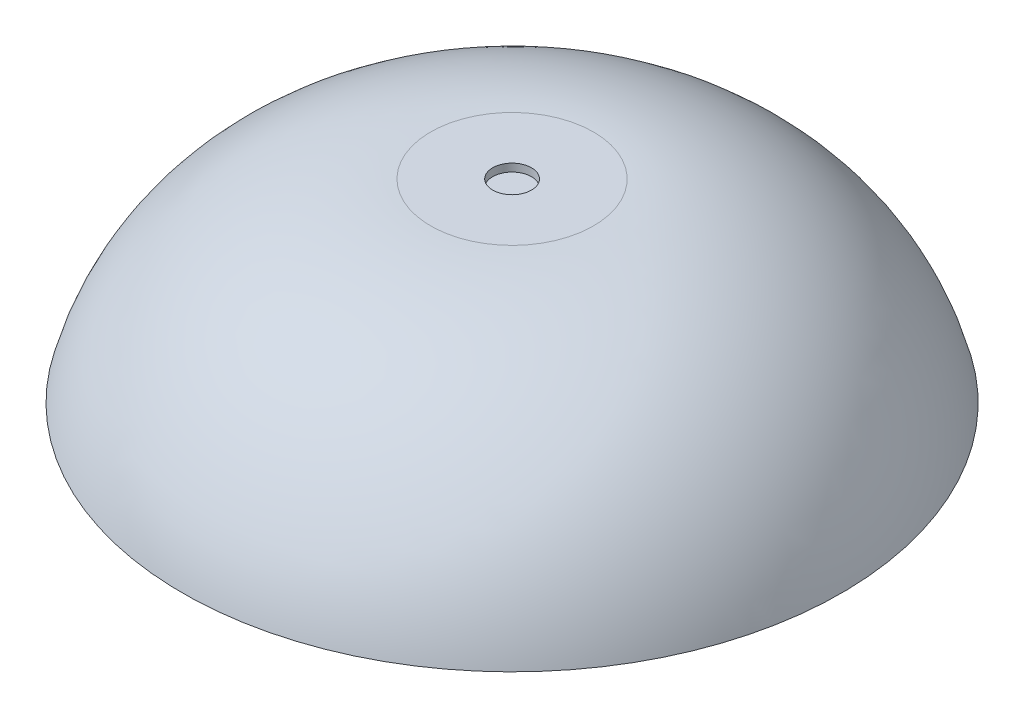
ISO-10303-21;
HEADER;
FILE_DESCRIPTION(('STEP AP214'),'2;1');
FILE_NAME('part.step','',(''),(''),'','','');
FILE_SCHEMA(('AUTOMOTIVE_DESIGN { 1 0 10303 214 1 1 1 1 }'));
ENDSEC;
DATA;
#1=APPLICATION_CONTEXT('core data for automotive mechanical design processes');
#2=APPLICATION_PROTOCOL_DEFINITION('international standard','automotive_design',2000,#1);
#3=PRODUCT_CONTEXT('',#1,'mechanical');
#4=PRODUCT('Part','Part','',(#3));
#5=PRODUCT_RELATED_PRODUCT_CATEGORY('part','',(#4));
#6=PRODUCT_DEFINITION_FORMATION('','',#4);
#7=PRODUCT_DEFINITION_CONTEXT('part definition',#1,'design');
#8=PRODUCT_DEFINITION('design','',#6,#7);
#9=PRODUCT_DEFINITION_SHAPE('','',#8);
#10=(LENGTH_UNIT() NAMED_UNIT(*) SI_UNIT(.MILLI.,.METRE.));
#11=(NAMED_UNIT(*) PLANE_ANGLE_UNIT() SI_UNIT($,.RADIAN.));
#12=(NAMED_UNIT(*) SI_UNIT($,.STERADIAN.) SOLID_ANGLE_UNIT());
#13=UNCERTAINTY_MEASURE_WITH_UNIT(LENGTH_MEASURE(1.E-05),#10,'distance_accuracy_value','');
#14=(GEOMETRIC_REPRESENTATION_CONTEXT(3) GLOBAL_UNCERTAINTY_ASSIGNED_CONTEXT((#13)) GLOBAL_UNIT_ASSIGNED_CONTEXT((#10,
#11,#12)) REPRESENTATION_CONTEXT('',''));
#15=CARTESIAN_POINT('',(0.,0.,0.));
#16=DIRECTION('',(0.,0.,1.));
#17=DIRECTION('',(1.,0.,0.));
#18=AXIS2_PLACEMENT_3D('',#15,#16,#17);
#19=CARTESIAN_POINT('',(0.,2.,0.));
#20=DIRECTION('',(0.,1.,0.));
#21=DIRECTION('',(0.,0.,1.));
#22=AXIS2_PLACEMENT_3D('',#19,#20,#21);
#23=PLANE('',#22);
#24=CARTESIAN_POINT('',(0.,2.,0.));
#25=DIRECTION('',(0.,-1.,0.));
#26=DIRECTION('',(0.,0.,-1.));
#27=AXIS2_PLACEMENT_3D('',#24,#25,#26);
#28=CIRCLE('',#27,82.3866434984028);
#29=CARTESIAN_POINT('',(0.,2.,-82.3866434984028));
#30=VERTEX_POINT('',#29);
#31=EDGE_CURVE('E10',#30,#30,#28,.T.);
#32=ORIENTED_EDGE('',*,*,#31,.F.);
#33=EDGE_LOOP('',(#32));
#34=FACE_BOUND('',#33,.T.);
#35=ADVANCED_FACE('F29',(#34),#23,.T.);
#36=CARTESIAN_POINT('',(0.,-15.96,0.));
#37=DIRECTION('',(0.,-1.,0.));
#38=DIRECTION('',(0.,0.,-1.));
#39=AXIS2_PLACEMENT_3D('',#36,#37,#38);
#40=DEGENERATE_TOROIDAL_SURFACE('',#39,21.,63.96,.T.);
#41=ORIENTED_EDGE('',*,*,#31,.T.);
#42=EDGE_LOOP('',(#41));
#43=FACE_BOUND('',#42,.T.);
#44=CARTESIAN_POINT('',(0.,48.,0.));
#45=DIRECTION('',(0.,-1.,0.));
#46=DIRECTION('',(0.,0.,-1.));
#47=AXIS2_PLACEMENT_3D('',#44,#45,#46);
#48=CIRCLE('',#47,21.);
#49=CARTESIAN_POINT('',(0.,48.,-21.));
#50=VERTEX_POINT('',#49);
#51=EDGE_CURVE('E35',#50,#50,#48,.T.);
#52=ORIENTED_EDGE('',*,*,#51,.F.);
#53=EDGE_LOOP('',(#52));
#54=FACE_BOUND('',#53,.T.);
#55=ADVANCED_FACE('F71',(#43,#54),#40,.F.);
#56=CARTESIAN_POINT('',(5.,48.,0.));
#57=DIRECTION('',(0.,-1.,0.));
#58=DIRECTION('',(0.,0.,-1.));
#59=AXIS2_PLACEMENT_3D('',#56,#57,#58);
#60=PLANE('',#59);
#61=ORIENTED_EDGE('',*,*,#51,.T.);
#62=EDGE_LOOP('',(#61));
#63=FACE_BOUND('',#62,.T.);
#64=CARTESIAN_POINT('',(0.,48.,0.));
#65=DIRECTION('',(0.,-1.,0.));
#66=DIRECTION('',(0.,0.,-1.));
#67=AXIS2_PLACEMENT_3D('',#64,#65,#66);
#68=CIRCLE('',#67,5.);
#69=CARTESIAN_POINT('',(0.,48.,-5.));
#70=VERTEX_POINT('',#69);
#71=EDGE_CURVE('E39',#70,#70,#68,.T.);
#72=ORIENTED_EDGE('',*,*,#71,.F.);
#73=EDGE_LOOP('',(#72));
#74=FACE_BOUND('',#73,.T.);
#75=ADVANCED_FACE('F76',(#63,#74),#60,.T.);
#76=CARTESIAN_POINT('',(0.,0.,0.));
#77=DIRECTION('',(0.,-1.,0.));
#78=DIRECTION('',(0.,0.,-1.));
#79=AXIS2_PLACEMENT_3D('',#76,#77,#78);
#80=CYLINDRICAL_SURFACE('',#79,5.);
#81=ORIENTED_EDGE('',*,*,#71,.T.);
#82=EDGE_LOOP('',(#81));
#83=FACE_BOUND('',#82,.T.);
#84=CARTESIAN_POINT('',(0.,50.,0.));
#85=DIRECTION('',(0.,-1.,0.));
#86=DIRECTION('',(0.,0.,-1.));
#87=AXIS2_PLACEMENT_3D('',#84,#85,#86);
#88=CIRCLE('',#87,5.);
#89=CARTESIAN_POINT('',(0.,50.,-5.));
#90=VERTEX_POINT('',#89);
#91=EDGE_CURVE('E43',#90,#90,#88,.T.);
#92=ORIENTED_EDGE('',*,*,#91,.F.);
#93=EDGE_LOOP('',(#92));
#94=FACE_BOUND('',#93,.T.);
#95=ADVANCED_FACE('F67',(#83,#94),#80,.F.);
#96=CARTESIAN_POINT('',(5.,50.,0.));
#97=DIRECTION('',(0.,1.,0.));
#98=DIRECTION('',(0.,0.,1.));
#99=AXIS2_PLACEMENT_3D('',#96,#97,#98);
#100=PLANE('',#99);
#101=ORIENTED_EDGE('',*,*,#91,.T.);
#102=EDGE_LOOP('',(#101));
#103=FACE_BOUND('',#102,.T.);
#104=CARTESIAN_POINT('',(0.,50.,0.));
#105=DIRECTION('',(0.,-1.,0.));
#106=DIRECTION('',(0.,0.,-1.));
#107=AXIS2_PLACEMENT_3D('',#104,#105,#106);
#108=CIRCLE('',#107,21.);
#109=CARTESIAN_POINT('',(0.,50.,-21.));
#110=VERTEX_POINT('',#109);
#111=EDGE_CURVE('E48',#110,#110,#108,.T.);
#112=ORIENTED_EDGE('',*,*,#111,.F.);
#113=EDGE_LOOP('',(#112));
#114=FACE_BOUND('',#113,.T.);
#115=ADVANCED_FACE('F59',(#103,#114),#100,.T.);
#116=CARTESIAN_POINT('',(0.,-15.96,0.));
#117=DIRECTION('',(0.,-1.,0.));
#118=DIRECTION('',(0.,0.,-1.));
#119=AXIS2_PLACEMENT_3D('',#116,#117,#118);
#120=DEGENERATE_TOROIDAL_SURFACE('',#119,21.,65.96,.T.);
#121=ORIENTED_EDGE('',*,*,#111,.T.);
#122=EDGE_LOOP('',(#121));
#123=FACE_BOUND('',#122,.T.);
#124=CARTESIAN_POINT('',(0.,0.,0.));
#125=DIRECTION('',(0.,-1.,0.));
#126=DIRECTION('',(0.,0.,-1.));
#127=AXIS2_PLACEMENT_3D('',#124,#125,#126);
#128=CIRCLE('',#127,85.);
#129=CARTESIAN_POINT('',(0.,0.,-85.));
#130=VERTEX_POINT('',#129);
#131=EDGE_CURVE('E51',#130,#130,#128,.T.);
#132=ORIENTED_EDGE('',*,*,#131,.F.);
#133=EDGE_LOOP('',(#132));
#134=FACE_BOUND('',#133,.T.);
#135=ADVANCED_FACE('F57',(#123,#134),#120,.T.);
#136=CARTESIAN_POINT('',(0.,0.,0.));
#137=DIRECTION('',(0.,-1.,0.));
#138=DIRECTION('',(0.,0.,-1.));
#139=AXIS2_PLACEMENT_3D('',#136,#137,#138);
#140=PLANE('',#139);
#141=ORIENTED_EDGE('',*,*,#131,.T.);
#142=EDGE_LOOP('',(#141));
#143=FACE_BOUND('',#142,.T.);
#144=ADVANCED_FACE('F55',(#143),#140,.T.);
#145=CLOSED_SHELL('',(#35,#55,#75,#95,#115,#135,#144));
#146=MANIFOLD_SOLID_BREP('B2',#145);
#147=ADVANCED_BREP_SHAPE_REPRESENTATION('',(#18,#146),#14);
#148=SHAPE_DEFINITION_REPRESENTATION(#9,#147);
ENDSEC;
END-ISO-10303-21;
